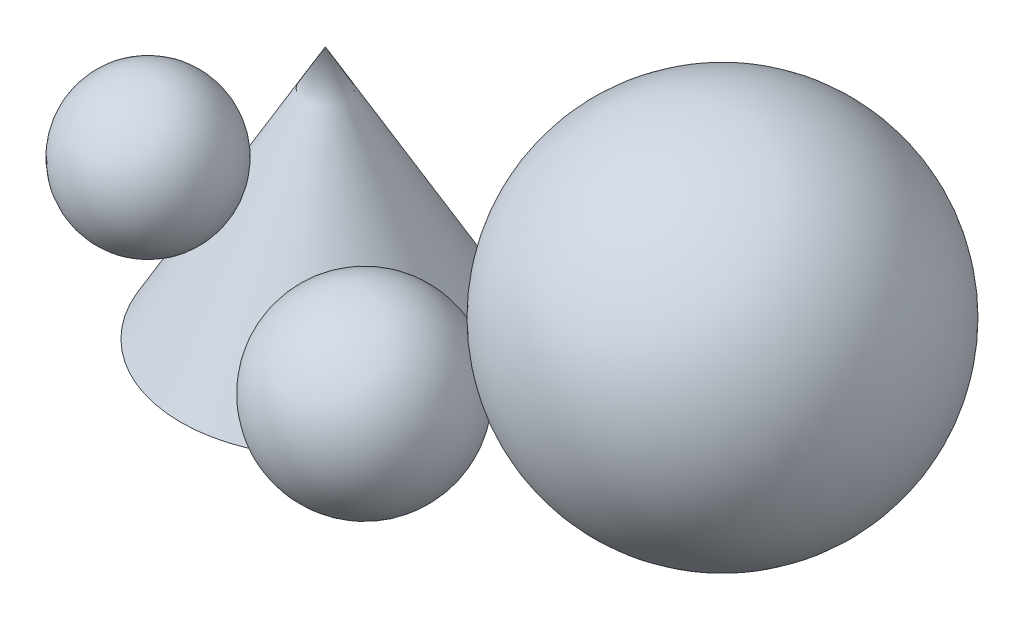
ISO-10303-21;
HEADER;
FILE_DESCRIPTION(('STEP AP214'),'2;1');
FILE_NAME('part.step','',(''),(''),'','','');
FILE_SCHEMA(('AUTOMOTIVE_DESIGN { 1 0 10303 214 1 1 1 1 }'));
ENDSEC;
DATA;
#1=APPLICATION_CONTEXT('core data for automotive mechanical design processes');
#2=APPLICATION_PROTOCOL_DEFINITION('international standard','automotive_design',2000,#1);
#3=PRODUCT_CONTEXT('',#1,'mechanical');
#4=PRODUCT('Part','Part','',(#3));
#5=PRODUCT_RELATED_PRODUCT_CATEGORY('part','',(#4));
#6=PRODUCT_DEFINITION_FORMATION('','',#4);
#7=PRODUCT_DEFINITION_CONTEXT('part definition',#1,'design');
#8=PRODUCT_DEFINITION('design','',#6,#7);
#9=PRODUCT_DEFINITION_SHAPE('','',#8);
#10=(LENGTH_UNIT() NAMED_UNIT(*) SI_UNIT(.MILLI.,.METRE.));
#11=(NAMED_UNIT(*) PLANE_ANGLE_UNIT() SI_UNIT($,.RADIAN.));
#12=(NAMED_UNIT(*) SI_UNIT($,.STERADIAN.) SOLID_ANGLE_UNIT());
#13=UNCERTAINTY_MEASURE_WITH_UNIT(LENGTH_MEASURE(1.E-05),#10,'distance_accuracy_value','');
#14=(GEOMETRIC_REPRESENTATION_CONTEXT(3) GLOBAL_UNCERTAINTY_ASSIGNED_CONTEXT((#13)) GLOBAL_UNIT_ASSIGNED_CONTEXT((#10,
#11,#12)) REPRESENTATION_CONTEXT('',''));
#15=CARTESIAN_POINT('',(0.,0.,0.));
#16=DIRECTION('',(0.,0.,1.));
#17=DIRECTION('',(1.,0.,0.));
#18=AXIS2_PLACEMENT_3D('',#15,#16,#17);
#19=CARTESIAN_POINT('',(-59.6322928261529,48.3742051068268,29.4484392392294));
#20=DIRECTION('',(0.,1.,0.));
#21=DIRECTION('',(-0.554700196225229,0.,0.832050294337844));
#22=AXIS2_PLACEMENT_3D('',#19,#20,#21);
#23=SPHERICAL_SURFACE('',#22,20.);
#24=CARTESIAN_POINT('',(-59.6322928261529,68.3742051068268,29.4484392392294));
#25=VERTEX_POINT('',#24);
#26=VERTEX_LOOP('',#25);
#27=FACE_BOUND('',#26,.T.);
#28=ADVANCED_FACE('F38',(#27),#23,.T.);
#29=CLOSED_SHELL('',(#28));
#30=MANIFOLD_SOLID_BREP('B2',#29);
#31=CARTESIAN_POINT('',(3.56727326260164,25.,32.7570095496992));
#32=DIRECTION('',(0.,0.,1.));
#33=DIRECTION('',(-1.,0.,0.));
#34=AXIS2_PLACEMENT_3D('',#31,#32,#33);
#35=SPHERICAL_SURFACE('',#34,25.);
#36=CARTESIAN_POINT('',(3.56727326260164,25.,57.7570095496992));
#37=VERTEX_POINT('',#36);
#38=VERTEX_LOOP('',#37);
#39=FACE_BOUND('',#38,.T.);
#40=ADVANCED_FACE('F59',(#39),#35,.T.);
#41=CLOSED_SHELL('',(#40));
#42=MANIFOLD_SOLID_BREP('B6',#41);
#43=CARTESIAN_POINT('',(59.8863476012921,50.,-9.99999999999999));
#44=DIRECTION('',(-0.00227304210204917,0.999997416636464,0.));
#45=DIRECTION('',(0.999997416636464,0.00227304210204917,0.));
#46=AXIS2_PLACEMENT_3D('',#43,#44,#45);
#47=SPHERICAL_SURFACE('',#46,50.);
#48=CARTESIAN_POINT('',(22.3402980421651,33.3333333333333,18.5046730331328));
#49=VERTEX_POINT('',#48);
#50=VERTEX_LOOP('',#49);
#51=FACE_BOUND('',#50,.T.);
#52=ADVANCED_FACE('F81',(#51),#47,.T.);
#53=CLOSED_SHELL('',(#52));
#54=MANIFOLD_SOLID_BREP('B34',#53);
#55=CARTESIAN_POINT('',(-40.,0.,0.));
#56=DIRECTION('',(0.,1.,0.));
#57=DIRECTION('',(0.,0.,1.));
#58=AXIS2_PLACEMENT_3D('',#55,#56,#57);
#59=PLANE('',#58);
#60=CARTESIAN_POINT('',(-40.,0.,0.));
#61=DIRECTION('',(0.,1.,0.));
#62=DIRECTION('',(0.,0.,1.));
#63=AXIS2_PLACEMENT_3D('',#60,#61,#62);
#64=CIRCLE('',#63,40.);
#65=CARTESIAN_POINT('',(-40.,0.,40.));
#66=VERTEX_POINT('',#65);
#67=EDGE_CURVE('E79',#66,#66,#64,.T.);
#68=ORIENTED_EDGE('',*,*,#67,.F.);
#69=EDGE_LOOP('',(#68));
#70=FACE_BOUND('',#69,.T.);
#71=ADVANCED_FACE('F94',(#70),#59,.F.);
#72=CARTESIAN_POINT('',(-40.,0.,0.));
#73=DIRECTION('',(0.,-1.,0.));
#74=DIRECTION('',(0.,0.,-1.));
#75=AXIS2_PLACEMENT_3D('',#72,#73,#74);
#76=CONICAL_SURFACE('',#75,40.,0.519146114246523);
#77=CARTESIAN_POINT('',(-50.,38.4514263396901,15.));
#78=VERTEX_POINT('',#77);
#79=VERTEX_LOOP('',#78);
#80=FACE_BOUND('',#79,.T.);
#81=CARTESIAN_POINT('',(-13.7819884250233,12.5965265410792,19.7125867932812));
#82=VERTEX_POINT('',#81);
#83=VERTEX_LOOP('',#82);
#84=FACE_BOUND('',#83,.T.);
#85=CARTESIAN_POINT('',(-40.,70.,0.));
#86=VERTEX_POINT('',#85);
#87=VERTEX_LOOP('',#86);
#88=FACE_BOUND('',#87,.T.);
#89=ORIENTED_EDGE('',*,*,#67,.T.);
#90=EDGE_LOOP('',(#89));
#91=FACE_BOUND('',#90,.T.);
#92=ADVANCED_FACE('F109',(#80,#84,#88,#91),#76,.T.);
#93=CLOSED_SHELL('',(#71,#92));
#94=MANIFOLD_SOLID_BREP('B53',#93);
#95=ADVANCED_BREP_SHAPE_REPRESENTATION('',(#18,#30,#42,#54,#94),#14);
#96=SHAPE_DEFINITION_REPRESENTATION(#9,#95);
ENDSEC;
END-ISO-10303-21;
